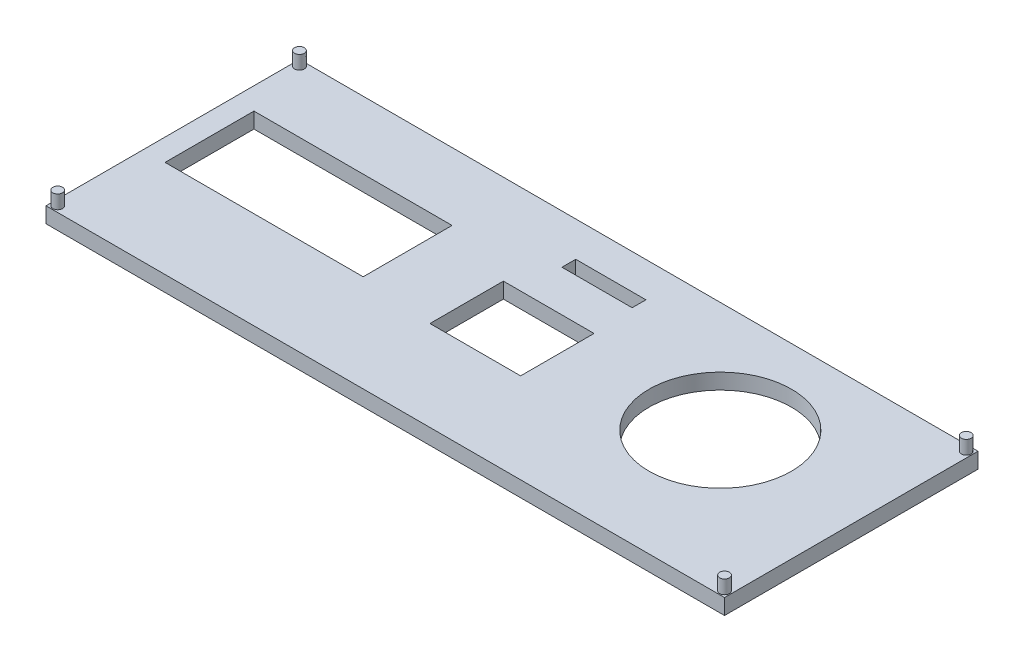
ISO-10303-21;
HEADER;
FILE_DESCRIPTION(('STEP AP214'),'2;1');
FILE_NAME('part.step','',(''),(''),'','','');
FILE_SCHEMA(('AUTOMOTIVE_DESIGN { 1 0 10303 214 1 1 1 1 }'));
ENDSEC;
DATA;
#1=APPLICATION_CONTEXT('core data for automotive mechanical design processes');
#2=APPLICATION_PROTOCOL_DEFINITION('international standard','automotive_design',2000,#1);
#3=PRODUCT_CONTEXT('',#1,'mechanical');
#4=PRODUCT('Part','Part','',(#3));
#5=PRODUCT_RELATED_PRODUCT_CATEGORY('part','',(#4));
#6=PRODUCT_DEFINITION_FORMATION('','',#4);
#7=PRODUCT_DEFINITION_CONTEXT('part definition',#1,'design');
#8=PRODUCT_DEFINITION('design','',#6,#7);
#9=PRODUCT_DEFINITION_SHAPE('','',#8);
#10=(LENGTH_UNIT() NAMED_UNIT(*) SI_UNIT(.MILLI.,.METRE.));
#11=(NAMED_UNIT(*) PLANE_ANGLE_UNIT() SI_UNIT($,.RADIAN.));
#12=(NAMED_UNIT(*) SI_UNIT($,.STERADIAN.) SOLID_ANGLE_UNIT());
#13=UNCERTAINTY_MEASURE_WITH_UNIT(LENGTH_MEASURE(1.E-05),#10,'distance_accuracy_value','');
#14=(GEOMETRIC_REPRESENTATION_CONTEXT(3) GLOBAL_UNCERTAINTY_ASSIGNED_CONTEXT((#13)) GLOBAL_UNIT_ASSIGNED_CONTEXT((#10,
#11,#12)) REPRESENTATION_CONTEXT('',''));
#15=CARTESIAN_POINT('',(0.,0.,0.));
#16=DIRECTION('',(0.,0.,1.));
#17=DIRECTION('',(1.,0.,0.));
#18=AXIS2_PLACEMENT_3D('',#15,#16,#17);
#19=CARTESIAN_POINT('',(-87.,4.,32.5));
#20=DIRECTION('',(1.,0.,0.));
#21=DIRECTION('',(0.,0.,-1.));
#22=AXIS2_PLACEMENT_3D('',#19,#20,#21);
#23=PLANE('',#22);
#24=DIRECTION('',(0.,0.,1.));
#25=VECTOR('',#24,1.);
#26=CARTESIAN_POINT('',(-87.,0.,32.5));
#27=LINE('',#26,#25);
#28=CARTESIAN_POINT('',(-87.,0.,-32.5));
#29=VERTEX_POINT('',#28);
#30=CARTESIAN_POINT('',(-87.,0.,32.5));
#31=VERTEX_POINT('',#30);
#32=EDGE_CURVE('E259',#29,#31,#27,.T.);
#33=ORIENTED_EDGE('',*,*,#32,.T.);
#34=DIRECTION('',(0.,-1.,0.));
#35=VECTOR('',#34,1.);
#36=CARTESIAN_POINT('',(-87.,4.,32.5));
#37=LINE('',#36,#35);
#38=CARTESIAN_POINT('',(-87.,4.,32.5));
#39=VERTEX_POINT('',#38);
#40=EDGE_CURVE('E11',#39,#31,#37,.T.);
#41=ORIENTED_EDGE('',*,*,#40,.F.);
#42=DIRECTION('',(0.,0.,1.));
#43=VECTOR('',#42,1.);
#44=CARTESIAN_POINT('',(-87.,4.,32.5));
#45=LINE('',#44,#43);
#46=CARTESIAN_POINT('',(-87.,4.,-32.5));
#47=VERTEX_POINT('',#46);
#48=EDGE_CURVE('E262',#47,#39,#45,.T.);
#49=ORIENTED_EDGE('',*,*,#48,.F.);
#50=DIRECTION('',(0.,-1.,0.));
#51=VECTOR('',#50,1.);
#52=CARTESIAN_POINT('',(-87.,4.,-32.5));
#53=LINE('',#52,#51);
#54=EDGE_CURVE('E272',#47,#29,#53,.T.);
#55=ORIENTED_EDGE('',*,*,#54,.T.);
#56=EDGE_LOOP('',(#33,#41,#49,#55));
#57=FACE_BOUND('',#56,.T.);
#58=ADVANCED_FACE('F39',(#57),#23,.F.);
#59=CARTESIAN_POINT('',(87.,4.,32.5));
#60=DIRECTION('',(0.,0.,-1.));
#61=DIRECTION('',(-1.,0.,0.));
#62=AXIS2_PLACEMENT_3D('',#59,#60,#61);
#63=PLANE('',#62);
#64=DIRECTION('',(1.,0.,0.));
#65=VECTOR('',#64,1.);
#66=CARTESIAN_POINT('',(87.,0.,32.5));
#67=LINE('',#66,#65);
#68=CARTESIAN_POINT('',(87.,0.,32.5));
#69=VERTEX_POINT('',#68);
#70=EDGE_CURVE('E275',#31,#69,#67,.T.);
#71=ORIENTED_EDGE('',*,*,#70,.T.);
#72=DIRECTION('',(0.,-1.,0.));
#73=VECTOR('',#72,1.);
#74=CARTESIAN_POINT('',(87.,4.,32.5));
#75=LINE('',#74,#73);
#76=CARTESIAN_POINT('',(87.,4.,32.5));
#77=VERTEX_POINT('',#76);
#78=EDGE_CURVE('E46',#77,#69,#75,.T.);
#79=ORIENTED_EDGE('',*,*,#78,.F.);
#80=DIRECTION('',(1.,0.,0.));
#81=VECTOR('',#80,1.);
#82=CARTESIAN_POINT('',(87.,4.,32.5));
#83=LINE('',#82,#81);
#84=EDGE_CURVE('E265',#39,#77,#83,.T.);
#85=ORIENTED_EDGE('',*,*,#84,.F.);
#86=ORIENTED_EDGE('',*,*,#40,.T.);
#87=EDGE_LOOP('',(#71,#79,#85,#86));
#88=FACE_BOUND('',#87,.T.);
#89=ADVANCED_FACE('F304',(#88),#63,.F.);
#90=CARTESIAN_POINT('',(87.,4.,32.5));
#91=DIRECTION('',(-1.,0.,0.));
#92=DIRECTION('',(0.,0.,1.));
#93=AXIS2_PLACEMENT_3D('',#90,#91,#92);
#94=PLANE('',#93);
#95=DIRECTION('',(0.,0.,-1.));
#96=VECTOR('',#95,1.);
#97=CARTESIAN_POINT('',(87.,0.,32.5));
#98=LINE('',#97,#96);
#99=CARTESIAN_POINT('',(87.,0.,-32.5));
#100=VERTEX_POINT('',#99);
#101=EDGE_CURVE('E277',#69,#100,#98,.T.);
#102=ORIENTED_EDGE('',*,*,#101,.T.);
#103=DIRECTION('',(0.,-1.,0.));
#104=VECTOR('',#103,1.);
#105=CARTESIAN_POINT('',(87.,4.,-32.5));
#106=LINE('',#105,#104);
#107=CARTESIAN_POINT('',(87.,4.,-32.5));
#108=VERTEX_POINT('',#107);
#109=EDGE_CURVE('E282',#108,#100,#106,.T.);
#110=ORIENTED_EDGE('',*,*,#109,.F.);
#111=DIRECTION('',(0.,0.,-1.));
#112=VECTOR('',#111,1.);
#113=CARTESIAN_POINT('',(87.,4.,32.5));
#114=LINE('',#113,#112);
#115=EDGE_CURVE('E268',#77,#108,#114,.T.);
#116=ORIENTED_EDGE('',*,*,#115,.F.);
#117=ORIENTED_EDGE('',*,*,#78,.T.);
#118=EDGE_LOOP('',(#102,#110,#116,#117));
#119=FACE_BOUND('',#118,.T.);
#120=ADVANCED_FACE('F289',(#119),#94,.F.);
#121=CARTESIAN_POINT('',(87.,4.,-32.5));
#122=DIRECTION('',(0.,0.,1.));
#123=DIRECTION('',(1.,0.,0.));
#124=AXIS2_PLACEMENT_3D('',#121,#122,#123);
#125=PLANE('',#124);
#126=DIRECTION('',(-1.,0.,0.));
#127=VECTOR('',#126,1.);
#128=CARTESIAN_POINT('',(87.,0.,-32.5));
#129=LINE('',#128,#127);
#130=EDGE_CURVE('E266',#100,#29,#129,.T.);
#131=ORIENTED_EDGE('',*,*,#130,.T.);
#132=ORIENTED_EDGE('',*,*,#54,.F.);
#133=DIRECTION('',(-1.,0.,0.));
#134=VECTOR('',#133,1.);
#135=CARTESIAN_POINT('',(87.,4.,-32.5));
#136=LINE('',#135,#134);
#137=EDGE_CURVE('E270',#108,#47,#136,.T.);
#138=ORIENTED_EDGE('',*,*,#137,.F.);
#139=ORIENTED_EDGE('',*,*,#109,.T.);
#140=EDGE_LOOP('',(#131,#132,#138,#139));
#141=FACE_BOUND('',#140,.T.);
#142=ADVANCED_FACE('F297',(#141),#125,.F.);
#143=CARTESIAN_POINT('',(0.,4.,0.));
#144=DIRECTION('',(0.,1.,0.));
#145=DIRECTION('',(0.,0.,1.));
#146=AXIS2_PLACEMENT_3D('',#143,#144,#145);
#147=PLANE('',#146);
#148=CARTESIAN_POINT('',(85.5,4.,31.));
#149=DIRECTION('',(0.,1.,0.));
#150=DIRECTION('',(0.,0.,1.));
#151=AXIS2_PLACEMENT_3D('',#148,#149,#150);
#152=CIRCLE('',#151,1.25);
#153=CARTESIAN_POINT('',(85.5,4.,32.25));
#154=VERTEX_POINT('',#153);
#155=EDGE_CURVE('E405',#154,#154,#152,.T.);
#156=ORIENTED_EDGE('',*,*,#155,.F.);
#157=EDGE_LOOP('',(#156));
#158=FACE_BOUND('',#157,.T.);
#159=CARTESIAN_POINT('',(85.5,4.,-31.));
#160=DIRECTION('',(0.,1.,0.));
#161=DIRECTION('',(0.,0.,1.));
#162=AXIS2_PLACEMENT_3D('',#159,#160,#161);
#163=CIRCLE('',#162,1.25);
#164=CARTESIAN_POINT('',(85.5,4.,-29.75));
#165=VERTEX_POINT('',#164);
#166=EDGE_CURVE('E406',#165,#165,#163,.T.);
#167=ORIENTED_EDGE('',*,*,#166,.F.);
#168=EDGE_LOOP('',(#167));
#169=FACE_BOUND('',#168,.T.);
#170=CARTESIAN_POINT('',(-85.5,4.,31.));
#171=DIRECTION('',(0.,1.,0.));
#172=DIRECTION('',(0.,0.,1.));
#173=AXIS2_PLACEMENT_3D('',#170,#171,#172);
#174=CIRCLE('',#173,1.25);
#175=CARTESIAN_POINT('',(-85.5,4.,32.25));
#176=VERTEX_POINT('',#175);
#177=EDGE_CURVE('E416',#176,#176,#174,.T.);
#178=ORIENTED_EDGE('',*,*,#177,.F.);
#179=EDGE_LOOP('',(#178));
#180=FACE_BOUND('',#179,.T.);
#181=CARTESIAN_POINT('',(-85.5,4.,-31.));
#182=DIRECTION('',(0.,1.,0.));
#183=DIRECTION('',(0.,0.,1.));
#184=AXIS2_PLACEMENT_3D('',#181,#182,#183);
#185=CIRCLE('',#184,1.25);
#186=CARTESIAN_POINT('',(-85.5,4.,-29.75));
#187=VERTEX_POINT('',#186);
#188=EDGE_CURVE('E175',#187,#187,#185,.T.);
#189=ORIENTED_EDGE('',*,*,#188,.F.);
#190=EDGE_LOOP('',(#189));
#191=FACE_BOUND('',#190,.T.);
#192=DIRECTION('',(0.,0.,-1.));
#193=VECTOR('',#192,1.);
#194=CARTESIAN_POINT('',(11.6243241915725,4.,9.41717402861569));
#195=LINE('',#194,#193);
#196=CARTESIAN_POINT('',(11.6243241915725,4.,9.41717402861569));
#197=VERTEX_POINT('',#196);
#198=CARTESIAN_POINT('',(11.6243241915725,4.,-9.41717402861569));
#199=VERTEX_POINT('',#198);
#200=EDGE_CURVE('E53',#197,#199,#195,.T.);
#201=ORIENTED_EDGE('',*,*,#200,.F.);
#202=DIRECTION('',(1.,0.,0.));
#203=VECTOR('',#202,1.);
#204=CARTESIAN_POINT('',(-11.6243241915725,4.,9.41717402861569));
#205=LINE('',#204,#203);
#206=CARTESIAN_POINT('',(-11.6243241915725,4.,9.41717402861569));
#207=VERTEX_POINT('',#206);
#208=EDGE_CURVE('E169',#207,#197,#205,.T.);
#209=ORIENTED_EDGE('',*,*,#208,.F.);
#210=DIRECTION('',(0.,0.,1.));
#211=VECTOR('',#210,1.);
#212=CARTESIAN_POINT('',(-11.6243241915725,4.,9.41717402861569));
#213=LINE('',#212,#211);
#214=CARTESIAN_POINT('',(-11.6243241915725,4.,-9.41717402861569));
#215=VERTEX_POINT('',#214);
#216=EDGE_CURVE('E172',#215,#207,#213,.T.);
#217=ORIENTED_EDGE('',*,*,#216,.F.);
#218=DIRECTION('',(-1.,0.,0.));
#219=VECTOR('',#218,1.);
#220=CARTESIAN_POINT('',(-11.6243241915725,4.,-9.41717402861569));
#221=LINE('',#220,#219);
#222=EDGE_CURVE('E181',#199,#215,#221,.T.);
#223=ORIENTED_EDGE('',*,*,#222,.F.);
#224=EDGE_LOOP('',(#201,#209,#217,#223));
#225=FACE_BOUND('',#224,.T.);
#226=DIRECTION('',(0.,0.,1.));
#227=VECTOR('',#226,1.);
#228=CARTESIAN_POINT('',(-7.19999999999999,4.,-20.0114948108083));
#229=LINE('',#228,#227);
#230=CARTESIAN_POINT('',(-7.19999999999999,4.,-23.5429350715392));
#231=VERTEX_POINT('',#230);
#232=CARTESIAN_POINT('',(-7.19999999999999,4.,-20.0114948108083));
#233=VERTEX_POINT('',#232);
#234=EDGE_CURVE('E188',#231,#233,#229,.T.);
#235=ORIENTED_EDGE('',*,*,#234,.F.);
#236=DIRECTION('',(-1.,0.,0.));
#237=VECTOR('',#236,1.);
#238=CARTESIAN_POINT('',(-7.19999999999999,4.,-23.5429350715392));
#239=LINE('',#238,#237);
#240=CARTESIAN_POINT('',(10.8,4.,-23.5429350715392));
#241=VERTEX_POINT('',#240);
#242=EDGE_CURVE('E196',#241,#231,#239,.T.);
#243=ORIENTED_EDGE('',*,*,#242,.F.);
#244=DIRECTION('',(0.,0.,-1.));
#245=VECTOR('',#244,1.);
#246=CARTESIAN_POINT('',(10.8,4.,-20.0114948108083));
#247=LINE('',#246,#245);
#248=CARTESIAN_POINT('',(10.8,4.,-20.0114948108083));
#249=VERTEX_POINT('',#248);
#250=EDGE_CURVE('E210',#249,#241,#247,.T.);
#251=ORIENTED_EDGE('',*,*,#250,.F.);
#252=DIRECTION('',(1.,0.,0.));
#253=VECTOR('',#252,1.);
#254=CARTESIAN_POINT('',(-7.19999999999999,4.,-20.0114948108083));
#255=LINE('',#254,#253);
#256=EDGE_CURVE('E207',#233,#249,#255,.T.);
#257=ORIENTED_EDGE('',*,*,#256,.F.);
#258=EDGE_LOOP('',(#235,#243,#251,#257));
#259=FACE_BOUND('',#258,.T.);
#260=DIRECTION('',(0.,0.,-1.));
#261=VECTOR('',#260,1.);
#262=CARTESIAN_POINT('',(-30.5702693410073,4.,-15.2));
#263=LINE('',#262,#261);
#264=CARTESIAN_POINT('',(-30.5702693410073,4.,7.59999999999999));
#265=VERTEX_POINT('',#264);
#266=CARTESIAN_POINT('',(-30.5702693410073,4.,-15.2));
#267=VERTEX_POINT('',#266);
#268=EDGE_CURVE('E217',#265,#267,#263,.T.);
#269=ORIENTED_EDGE('',*,*,#268,.F.);
#270=DIRECTION('',(1.,0.,0.));
#271=VECTOR('',#270,1.);
#272=CARTESIAN_POINT('',(-30.5702693410073,4.,7.59999999999999));
#273=LINE('',#272,#271);
#274=CARTESIAN_POINT('',(-81.3702693410073,4.,7.6));
#275=VERTEX_POINT('',#274);
#276=EDGE_CURVE('E228',#275,#265,#273,.T.);
#277=ORIENTED_EDGE('',*,*,#276,.F.);
#278=DIRECTION('',(0.,0.,1.));
#279=VECTOR('',#278,1.);
#280=CARTESIAN_POINT('',(-81.3702693410073,4.,-15.2));
#281=LINE('',#280,#279);
#282=CARTESIAN_POINT('',(-81.3702693410073,4.,-15.2));
#283=VERTEX_POINT('',#282);
#284=EDGE_CURVE('E242',#283,#275,#281,.T.);
#285=ORIENTED_EDGE('',*,*,#284,.F.);
#286=DIRECTION('',(-1.,0.,0.));
#287=VECTOR('',#286,1.);
#288=CARTESIAN_POINT('',(-30.5702693410073,4.,-15.2));
#289=LINE('',#288,#287);
#290=EDGE_CURVE('E239',#267,#283,#289,.T.);
#291=ORIENTED_EDGE('',*,*,#290,.F.);
#292=EDGE_LOOP('',(#269,#277,#285,#291));
#293=FACE_BOUND('',#292,.T.);
#294=CARTESIAN_POINT('',(49.2930203060352,4.,-4.12001363751938));
#295=DIRECTION('',(0.,1.,0.));
#296=DIRECTION('',(0.,0.,1.));
#297=AXIS2_PLACEMENT_3D('',#294,#295,#296);
#298=CIRCLE('',#297,18.25);
#299=CARTESIAN_POINT('',(49.2930203060352,4.,14.1299863624806));
#300=VERTEX_POINT('',#299);
#301=EDGE_CURVE('E249',#300,#300,#298,.T.);
#302=ORIENTED_EDGE('',*,*,#301,.F.);
#303=EDGE_LOOP('',(#302));
#304=FACE_BOUND('',#303,.T.);
#305=ORIENTED_EDGE('',*,*,#48,.T.);
#306=ORIENTED_EDGE('',*,*,#84,.T.);
#307=ORIENTED_EDGE('',*,*,#115,.T.);
#308=ORIENTED_EDGE('',*,*,#137,.T.);
#309=EDGE_LOOP('',(#305,#306,#307,#308));
#310=FACE_BOUND('',#309,.T.);
#311=ADVANCED_FACE('F303',(#158,#169,#180,#191,#225,#259,#293,#304,#310),#147,.T.);
#312=CARTESIAN_POINT('',(0.,0.,0.));
#313=DIRECTION('',(0.,1.,0.));
#314=DIRECTION('',(0.,0.,1.));
#315=AXIS2_PLACEMENT_3D('',#312,#313,#314);
#316=PLANE('',#315);
#317=DIRECTION('',(1.,0.,0.));
#318=VECTOR('',#317,1.);
#319=CARTESIAN_POINT('',(-11.6243241915725,0.,9.41717402861569));
#320=LINE('',#319,#318);
#321=CARTESIAN_POINT('',(-11.6243241915725,0.,9.41717402861569));
#322=VERTEX_POINT('',#321);
#323=CARTESIAN_POINT('',(11.6243241915725,0.,9.41717402861569));
#324=VERTEX_POINT('',#323);
#325=EDGE_CURVE('E159',#322,#324,#320,.T.);
#326=ORIENTED_EDGE('',*,*,#325,.T.);
#327=DIRECTION('',(0.,0.,-1.));
#328=VECTOR('',#327,1.);
#329=CARTESIAN_POINT('',(11.6243241915725,0.,9.41717402861569));
#330=LINE('',#329,#328);
#331=CARTESIAN_POINT('',(11.6243241915725,0.,-9.41717402861569));
#332=VERTEX_POINT('',#331);
#333=EDGE_CURVE('E153',#324,#332,#330,.T.);
#334=ORIENTED_EDGE('',*,*,#333,.T.);
#335=DIRECTION('',(-1.,0.,0.));
#336=VECTOR('',#335,1.);
#337=CARTESIAN_POINT('',(-11.6243241915725,0.,-9.41717402861569));
#338=LINE('',#337,#336);
#339=CARTESIAN_POINT('',(-11.6243241915725,0.,-9.41717402861569));
#340=VERTEX_POINT('',#339);
#341=EDGE_CURVE('E162',#332,#340,#338,.T.);
#342=ORIENTED_EDGE('',*,*,#341,.T.);
#343=DIRECTION('',(0.,0.,1.));
#344=VECTOR('',#343,1.);
#345=CARTESIAN_POINT('',(-11.6243241915725,0.,9.41717402861569));
#346=LINE('',#345,#344);
#347=EDGE_CURVE('E61',#340,#322,#346,.T.);
#348=ORIENTED_EDGE('',*,*,#347,.T.);
#349=EDGE_LOOP('',(#326,#334,#342,#348));
#350=FACE_BOUND('',#349,.T.);
#351=DIRECTION('',(-1.,0.,0.));
#352=VECTOR('',#351,1.);
#353=CARTESIAN_POINT('',(-7.19999999999999,0.,-23.5429350715392));
#354=LINE('',#353,#352);
#355=CARTESIAN_POINT('',(10.8,0.,-23.5429350715392));
#356=VERTEX_POINT('',#355);
#357=CARTESIAN_POINT('',(-7.19999999999999,0.,-23.5429350715392));
#358=VERTEX_POINT('',#357);
#359=EDGE_CURVE('E202',#356,#358,#354,.T.);
#360=ORIENTED_EDGE('',*,*,#359,.T.);
#361=DIRECTION('',(0.,0.,1.));
#362=VECTOR('',#361,1.);
#363=CARTESIAN_POINT('',(-7.19999999999999,0.,-20.0114948108083));
#364=LINE('',#363,#362);
#365=CARTESIAN_POINT('',(-7.19999999999999,0.,-20.0114948108083));
#366=VERTEX_POINT('',#365);
#367=EDGE_CURVE('E192',#358,#366,#364,.T.);
#368=ORIENTED_EDGE('',*,*,#367,.T.);
#369=DIRECTION('',(1.,0.,0.));
#370=VECTOR('',#369,1.);
#371=CARTESIAN_POINT('',(-7.19999999999999,0.,-20.0114948108083));
#372=LINE('',#371,#370);
#373=CARTESIAN_POINT('',(10.8,0.,-20.0114948108083));
#374=VERTEX_POINT('',#373);
#375=EDGE_CURVE('E195',#366,#374,#372,.T.);
#376=ORIENTED_EDGE('',*,*,#375,.T.);
#377=DIRECTION('',(0.,0.,-1.));
#378=VECTOR('',#377,1.);
#379=CARTESIAN_POINT('',(10.8,0.,-20.0114948108083));
#380=LINE('',#379,#378);
#381=EDGE_CURVE('E199',#374,#356,#380,.T.);
#382=ORIENTED_EDGE('',*,*,#381,.T.);
#383=EDGE_LOOP('',(#360,#368,#376,#382));
#384=FACE_BOUND('',#383,.T.);
#385=DIRECTION('',(1.,0.,0.));
#386=VECTOR('',#385,1.);
#387=CARTESIAN_POINT('',(-30.5702693410073,0.,7.59999999999999));
#388=LINE('',#387,#386);
#389=CARTESIAN_POINT('',(-81.3702693410073,0.,7.6));
#390=VERTEX_POINT('',#389);
#391=CARTESIAN_POINT('',(-30.5702693410073,0.,7.59999999999999));
#392=VERTEX_POINT('',#391);
#393=EDGE_CURVE('E234',#390,#392,#388,.T.);
#394=ORIENTED_EDGE('',*,*,#393,.T.);
#395=DIRECTION('',(0.,0.,-1.));
#396=VECTOR('',#395,1.);
#397=CARTESIAN_POINT('',(-30.5702693410073,0.,-15.2));
#398=LINE('',#397,#396);
#399=CARTESIAN_POINT('',(-30.5702693410073,0.,-15.2));
#400=VERTEX_POINT('',#399);
#401=EDGE_CURVE('E224',#392,#400,#398,.T.);
#402=ORIENTED_EDGE('',*,*,#401,.T.);
#403=DIRECTION('',(-1.,0.,0.));
#404=VECTOR('',#403,1.);
#405=CARTESIAN_POINT('',(-30.5702693410073,0.,-15.2));
#406=LINE('',#405,#404);
#407=CARTESIAN_POINT('',(-81.3702693410073,0.,-15.2));
#408=VERTEX_POINT('',#407);
#409=EDGE_CURVE('E227',#400,#408,#406,.T.);
#410=ORIENTED_EDGE('',*,*,#409,.T.);
#411=DIRECTION('',(0.,0.,1.));
#412=VECTOR('',#411,1.);
#413=CARTESIAN_POINT('',(-81.3702693410073,0.,-15.2));
#414=LINE('',#413,#412);
#415=EDGE_CURVE('E231',#408,#390,#414,.T.);
#416=ORIENTED_EDGE('',*,*,#415,.T.);
#417=EDGE_LOOP('',(#394,#402,#410,#416));
#418=FACE_BOUND('',#417,.T.);
#419=CARTESIAN_POINT('',(49.2930203060352,0.,-4.12001363751938));
#420=DIRECTION('',(0.,1.,0.));
#421=DIRECTION('',(0.,0.,1.));
#422=AXIS2_PLACEMENT_3D('',#419,#420,#421);
#423=CIRCLE('',#422,18.25);
#424=CARTESIAN_POINT('',(49.2930203060352,0.,14.1299863624806));
#425=VERTEX_POINT('',#424);
#426=EDGE_CURVE('E256',#425,#425,#423,.T.);
#427=ORIENTED_EDGE('',*,*,#426,.T.);
#428=EDGE_LOOP('',(#427));
#429=FACE_BOUND('',#428,.T.);
#430=ORIENTED_EDGE('',*,*,#32,.F.);
#431=ORIENTED_EDGE('',*,*,#130,.F.);
#432=ORIENTED_EDGE('',*,*,#101,.F.);
#433=ORIENTED_EDGE('',*,*,#70,.F.);
#434=EDGE_LOOP('',(#430,#431,#432,#433));
#435=FACE_BOUND('',#434,.T.);
#436=ADVANCED_FACE('F166',(#350,#384,#418,#429,#435),#316,.F.);
#437=CARTESIAN_POINT('',(49.2930203060352,0.,-4.12001363751938));
#438=DIRECTION('',(0.,1.,0.));
#439=DIRECTION('',(0.,0.,1.));
#440=AXIS2_PLACEMENT_3D('',#437,#438,#439);
#441=CYLINDRICAL_SURFACE('',#440,18.25);
#442=ORIENTED_EDGE('',*,*,#426,.F.);
#443=EDGE_LOOP('',(#442));
#444=FACE_BOUND('',#443,.T.);
#445=ORIENTED_EDGE('',*,*,#301,.T.);
#446=EDGE_LOOP('',(#445));
#447=FACE_BOUND('',#446,.T.);
#448=ADVANCED_FACE('F316',(#444,#447),#441,.F.);
#449=CARTESIAN_POINT('',(-30.5702693410073,0.,-15.2));
#450=DIRECTION('',(1.,0.,0.));
#451=DIRECTION('',(0.,0.,-1.));
#452=AXIS2_PLACEMENT_3D('',#449,#450,#451);
#453=PLANE('',#452);
#454=ORIENTED_EDGE('',*,*,#268,.T.);
#455=DIRECTION('',(0.,1.,0.));
#456=VECTOR('',#455,1.);
#457=CARTESIAN_POINT('',(-30.5702693410073,0.,-15.2));
#458=LINE('',#457,#456);
#459=EDGE_CURVE('E237',#400,#267,#458,.T.);
#460=ORIENTED_EDGE('',*,*,#459,.F.);
#461=ORIENTED_EDGE('',*,*,#401,.F.);
#462=DIRECTION('',(0.,1.,0.));
#463=VECTOR('',#462,1.);
#464=CARTESIAN_POINT('',(-30.5702693410073,0.,7.59999999999999));
#465=LINE('',#464,#463);
#466=EDGE_CURVE('E247',#392,#265,#465,.T.);
#467=ORIENTED_EDGE('',*,*,#466,.T.);
#468=EDGE_LOOP('',(#454,#460,#461,#467));
#469=FACE_BOUND('',#468,.T.);
#470=ADVANCED_FACE('F322',(#469),#453,.F.);
#471=CARTESIAN_POINT('',(-30.5702693410073,0.,7.59999999999999));
#472=DIRECTION('',(0.,0.,1.));
#473=DIRECTION('',(1.,0.,0.));
#474=AXIS2_PLACEMENT_3D('',#471,#472,#473);
#475=PLANE('',#474);
#476=ORIENTED_EDGE('',*,*,#276,.T.);
#477=ORIENTED_EDGE('',*,*,#466,.F.);
#478=ORIENTED_EDGE('',*,*,#393,.F.);
#479=DIRECTION('',(0.,1.,0.));
#480=VECTOR('',#479,1.);
#481=CARTESIAN_POINT('',(-81.3702693410073,0.,7.6));
#482=LINE('',#481,#480);
#483=EDGE_CURVE('E250',#390,#275,#482,.T.);
#484=ORIENTED_EDGE('',*,*,#483,.T.);
#485=EDGE_LOOP('',(#476,#477,#478,#484));
#486=FACE_BOUND('',#485,.T.);
#487=ADVANCED_FACE('F326',(#486),#475,.F.);
#488=CARTESIAN_POINT('',(-81.3702693410073,0.,-15.2));
#489=DIRECTION('',(-1.,0.,0.));
#490=DIRECTION('',(0.,0.,1.));
#491=AXIS2_PLACEMENT_3D('',#488,#489,#490);
#492=PLANE('',#491);
#493=ORIENTED_EDGE('',*,*,#284,.T.);
#494=ORIENTED_EDGE('',*,*,#483,.F.);
#495=ORIENTED_EDGE('',*,*,#415,.F.);
#496=DIRECTION('',(0.,1.,0.));
#497=VECTOR('',#496,1.);
#498=CARTESIAN_POINT('',(-81.3702693410073,0.,-15.2));
#499=LINE('',#498,#497);
#500=EDGE_CURVE('E252',#408,#283,#499,.T.);
#501=ORIENTED_EDGE('',*,*,#500,.T.);
#502=EDGE_LOOP('',(#493,#494,#495,#501));
#503=FACE_BOUND('',#502,.T.);
#504=ADVANCED_FACE('F332',(#503),#492,.F.);
#505=CARTESIAN_POINT('',(-30.5702693410073,0.,-15.2));
#506=DIRECTION('',(0.,0.,-1.));
#507=DIRECTION('',(-1.,0.,0.));
#508=AXIS2_PLACEMENT_3D('',#505,#506,#507);
#509=PLANE('',#508);
#510=ORIENTED_EDGE('',*,*,#290,.T.);
#511=ORIENTED_EDGE('',*,*,#500,.F.);
#512=ORIENTED_EDGE('',*,*,#409,.F.);
#513=ORIENTED_EDGE('',*,*,#459,.T.);
#514=EDGE_LOOP('',(#510,#511,#512,#513));
#515=FACE_BOUND('',#514,.T.);
#516=ADVANCED_FACE('F328',(#515),#509,.F.);
#517=CARTESIAN_POINT('',(-7.19999999999999,0.,-20.0114948108083));
#518=DIRECTION('',(-1.,0.,0.));
#519=DIRECTION('',(0.,0.,1.));
#520=AXIS2_PLACEMENT_3D('',#517,#518,#519);
#521=PLANE('',#520);
#522=ORIENTED_EDGE('',*,*,#234,.T.);
#523=DIRECTION('',(0.,1.,0.));
#524=VECTOR('',#523,1.);
#525=CARTESIAN_POINT('',(-7.19999999999999,0.,-20.0114948108083));
#526=LINE('',#525,#524);
#527=EDGE_CURVE('E205',#366,#233,#526,.T.);
#528=ORIENTED_EDGE('',*,*,#527,.F.);
#529=ORIENTED_EDGE('',*,*,#367,.F.);
#530=DIRECTION('',(0.,1.,0.));
#531=VECTOR('',#530,1.);
#532=CARTESIAN_POINT('',(-7.19999999999999,0.,-23.5429350715392));
#533=LINE('',#532,#531);
#534=EDGE_CURVE('E215',#358,#231,#533,.T.);
#535=ORIENTED_EDGE('',*,*,#534,.T.);
#536=EDGE_LOOP('',(#522,#528,#529,#535));
#537=FACE_BOUND('',#536,.T.);
#538=ADVANCED_FACE('F331',(#537),#521,.F.);
#539=CARTESIAN_POINT('',(-7.19999999999999,0.,-23.5429350715392));
#540=DIRECTION('',(0.,0.,-1.));
#541=DIRECTION('',(-1.,0.,0.));
#542=AXIS2_PLACEMENT_3D('',#539,#540,#541);
#543=PLANE('',#542);
#544=ORIENTED_EDGE('',*,*,#242,.T.);
#545=ORIENTED_EDGE('',*,*,#534,.F.);
#546=ORIENTED_EDGE('',*,*,#359,.F.);
#547=DIRECTION('',(0.,1.,0.));
#548=VECTOR('',#547,1.);
#549=CARTESIAN_POINT('',(10.8,0.,-23.5429350715392));
#550=LINE('',#549,#548);
#551=EDGE_CURVE('E218',#356,#241,#550,.T.);
#552=ORIENTED_EDGE('',*,*,#551,.T.);
#553=EDGE_LOOP('',(#544,#545,#546,#552));
#554=FACE_BOUND('',#553,.T.);
#555=ADVANCED_FACE('F342',(#554),#543,.F.);
#556=CARTESIAN_POINT('',(10.8,0.,-20.0114948108083));
#557=DIRECTION('',(1.,0.,0.));
#558=DIRECTION('',(0.,0.,-1.));
#559=AXIS2_PLACEMENT_3D('',#556,#557,#558);
#560=PLANE('',#559);
#561=ORIENTED_EDGE('',*,*,#250,.T.);
#562=ORIENTED_EDGE('',*,*,#551,.F.);
#563=ORIENTED_EDGE('',*,*,#381,.F.);
#564=DIRECTION('',(0.,1.,0.));
#565=VECTOR('',#564,1.);
#566=CARTESIAN_POINT('',(10.8,0.,-20.0114948108083));
#567=LINE('',#566,#565);
#568=EDGE_CURVE('E220',#374,#249,#567,.T.);
#569=ORIENTED_EDGE('',*,*,#568,.T.);
#570=EDGE_LOOP('',(#561,#562,#563,#569));
#571=FACE_BOUND('',#570,.T.);
#572=ADVANCED_FACE('F347',(#571),#560,.F.);
#573=CARTESIAN_POINT('',(-7.19999999999999,0.,-20.0114948108083));
#574=DIRECTION('',(0.,0.,1.));
#575=DIRECTION('',(1.,0.,0.));
#576=AXIS2_PLACEMENT_3D('',#573,#574,#575);
#577=PLANE('',#576);
#578=ORIENTED_EDGE('',*,*,#256,.T.);
#579=ORIENTED_EDGE('',*,*,#568,.F.);
#580=ORIENTED_EDGE('',*,*,#375,.F.);
#581=ORIENTED_EDGE('',*,*,#527,.T.);
#582=EDGE_LOOP('',(#578,#579,#580,#581));
#583=FACE_BOUND('',#582,.T.);
#584=ADVANCED_FACE('F344',(#583),#577,.F.);
#585=CARTESIAN_POINT('',(11.6243241915725,0.,9.41717402861569));
#586=DIRECTION('',(1.,0.,0.));
#587=DIRECTION('',(0.,0.,-1.));
#588=AXIS2_PLACEMENT_3D('',#585,#586,#587);
#589=PLANE('',#588);
#590=ORIENTED_EDGE('',*,*,#200,.T.);
#591=DIRECTION('',(0.,1.,0.));
#592=VECTOR('',#591,1.);
#593=CARTESIAN_POINT('',(11.6243241915725,0.,-9.41717402861569));
#594=LINE('',#593,#592);
#595=EDGE_CURVE('E149',#332,#199,#594,.T.);
#596=ORIENTED_EDGE('',*,*,#595,.F.);
#597=ORIENTED_EDGE('',*,*,#333,.F.);
#598=DIRECTION('',(0.,1.,0.));
#599=VECTOR('',#598,1.);
#600=CARTESIAN_POINT('',(11.6243241915725,0.,9.41717402861569));
#601=LINE('',#600,#599);
#602=EDGE_CURVE('E186',#324,#197,#601,.T.);
#603=ORIENTED_EDGE('',*,*,#602,.T.);
#604=EDGE_LOOP('',(#590,#596,#597,#603));
#605=FACE_BOUND('',#604,.T.);
#606=ADVANCED_FACE('F151',(#605),#589,.F.);
#607=CARTESIAN_POINT('',(-11.6243241915725,0.,9.41717402861569));
#608=DIRECTION('',(0.,0.,1.));
#609=DIRECTION('',(1.,0.,0.));
#610=AXIS2_PLACEMENT_3D('',#607,#608,#609);
#611=PLANE('',#610);
#612=ORIENTED_EDGE('',*,*,#208,.T.);
#613=ORIENTED_EDGE('',*,*,#602,.F.);
#614=ORIENTED_EDGE('',*,*,#325,.F.);
#615=DIRECTION('',(0.,1.,0.));
#616=VECTOR('',#615,1.);
#617=CARTESIAN_POINT('',(-11.6243241915725,0.,9.41717402861569));
#618=LINE('',#617,#616);
#619=EDGE_CURVE('E189',#322,#207,#618,.T.);
#620=ORIENTED_EDGE('',*,*,#619,.T.);
#621=EDGE_LOOP('',(#612,#613,#614,#620));
#622=FACE_BOUND('',#621,.T.);
#623=ADVANCED_FACE('F357',(#622),#611,.F.);
#624=CARTESIAN_POINT('',(-11.6243241915725,0.,9.41717402861569));
#625=DIRECTION('',(-1.,0.,0.));
#626=DIRECTION('',(0.,0.,1.));
#627=AXIS2_PLACEMENT_3D('',#624,#625,#626);
#628=PLANE('',#627);
#629=ORIENTED_EDGE('',*,*,#216,.T.);
#630=ORIENTED_EDGE('',*,*,#619,.F.);
#631=ORIENTED_EDGE('',*,*,#347,.F.);
#632=DIRECTION('',(0.,1.,0.));
#633=VECTOR('',#632,1.);
#634=CARTESIAN_POINT('',(-11.6243241915725,0.,-9.41717402861569));
#635=LINE('',#634,#633);
#636=EDGE_CURVE('E158',#340,#215,#635,.T.);
#637=ORIENTED_EDGE('',*,*,#636,.T.);
#638=EDGE_LOOP('',(#629,#630,#631,#637));
#639=FACE_BOUND('',#638,.T.);
#640=ADVANCED_FACE('F361',(#639),#628,.F.);
#641=CARTESIAN_POINT('',(-11.6243241915725,0.,-9.41717402861569));
#642=DIRECTION('',(0.,0.,-1.));
#643=DIRECTION('',(-1.,0.,0.));
#644=AXIS2_PLACEMENT_3D('',#641,#642,#643);
#645=PLANE('',#644);
#646=ORIENTED_EDGE('',*,*,#222,.T.);
#647=ORIENTED_EDGE('',*,*,#636,.F.);
#648=ORIENTED_EDGE('',*,*,#341,.F.);
#649=ORIENTED_EDGE('',*,*,#595,.T.);
#650=EDGE_LOOP('',(#646,#647,#648,#649));
#651=FACE_BOUND('',#650,.T.);
#652=ADVANCED_FACE('F163',(#651),#645,.F.);
#653=CARTESIAN_POINT('',(-85.5,7.5,-31.));
#654=DIRECTION('',(0.,-1.,0.));
#655=DIRECTION('',(0.,0.,-1.));
#656=AXIS2_PLACEMENT_3D('',#653,#654,#655);
#657=CYLINDRICAL_SURFACE('',#656,1.25);
#658=CARTESIAN_POINT('',(-85.5,7.5,-31.));
#659=DIRECTION('',(0.,1.,0.));
#660=DIRECTION('',(0.,0.,1.));
#661=AXIS2_PLACEMENT_3D('',#658,#659,#660);
#662=CIRCLE('',#661,1.25);
#663=CARTESIAN_POINT('',(-85.5,7.5,-29.75));
#664=VERTEX_POINT('',#663);
#665=EDGE_CURVE('E182',#664,#664,#662,.T.);
#666=ORIENTED_EDGE('',*,*,#665,.F.);
#667=EDGE_LOOP('',(#666));
#668=FACE_BOUND('',#667,.T.);
#669=ORIENTED_EDGE('',*,*,#188,.T.);
#670=EDGE_LOOP('',(#669));
#671=FACE_BOUND('',#670,.T.);
#672=ADVANCED_FACE('F360',(#668,#671),#657,.T.);
#673=CARTESIAN_POINT('',(-85.5,7.5,-31.));
#674=DIRECTION('',(0.,1.,0.));
#675=DIRECTION('',(0.,0.,1.));
#676=AXIS2_PLACEMENT_3D('',#673,#674,#675);
#677=PLANE('',#676);
#678=ORIENTED_EDGE('',*,*,#665,.T.);
#679=EDGE_LOOP('',(#678));
#680=FACE_BOUND('',#679,.T.);
#681=ADVANCED_FACE('F369',(#680),#677,.T.);
#682=CARTESIAN_POINT('',(-85.5,7.5,31.));
#683=DIRECTION('',(0.,-1.,0.));
#684=DIRECTION('',(0.,0.,-1.));
#685=AXIS2_PLACEMENT_3D('',#682,#683,#684);
#686=CYLINDRICAL_SURFACE('',#685,1.25);
#687=CARTESIAN_POINT('',(-85.5,7.5,31.));
#688=DIRECTION('',(0.,1.,0.));
#689=DIRECTION('',(0.,0.,1.));
#690=AXIS2_PLACEMENT_3D('',#687,#688,#689);
#691=CIRCLE('',#690,1.25);
#692=CARTESIAN_POINT('',(-85.5,7.5,32.25));
#693=VERTEX_POINT('',#692);
#694=EDGE_CURVE('E414',#693,#693,#691,.T.);
#695=ORIENTED_EDGE('',*,*,#694,.F.);
#696=EDGE_LOOP('',(#695));
#697=FACE_BOUND('',#696,.T.);
#698=ORIENTED_EDGE('',*,*,#177,.T.);
#699=EDGE_LOOP('',(#698));
#700=FACE_BOUND('',#699,.T.);
#701=ADVANCED_FACE('F373',(#697,#700),#686,.T.);
#702=CARTESIAN_POINT('',(-85.5,7.5,31.));
#703=DIRECTION('',(0.,1.,0.));
#704=DIRECTION('',(0.,0.,1.));
#705=AXIS2_PLACEMENT_3D('',#702,#703,#704);
#706=PLANE('',#705);
#707=ORIENTED_EDGE('',*,*,#694,.T.);
#708=EDGE_LOOP('',(#707));
#709=FACE_BOUND('',#708,.T.);
#710=ADVANCED_FACE('F375',(#709),#706,.T.);
#711=CARTESIAN_POINT('',(85.5,7.5,-31.));
#712=DIRECTION('',(0.,-1.,0.));
#713=DIRECTION('',(0.,0.,-1.));
#714=AXIS2_PLACEMENT_3D('',#711,#712,#713);
#715=CYLINDRICAL_SURFACE('',#714,1.25);
#716=CARTESIAN_POINT('',(85.5,7.5,-31.));
#717=DIRECTION('',(0.,1.,0.));
#718=DIRECTION('',(0.,0.,1.));
#719=AXIS2_PLACEMENT_3D('',#716,#717,#718);
#720=CIRCLE('',#719,1.25);
#721=CARTESIAN_POINT('',(85.5,7.5,-29.75));
#722=VERTEX_POINT('',#721);
#723=EDGE_CURVE('E409',#722,#722,#720,.T.);
#724=ORIENTED_EDGE('',*,*,#723,.F.);
#725=EDGE_LOOP('',(#724));
#726=FACE_BOUND('',#725,.T.);
#727=ORIENTED_EDGE('',*,*,#166,.T.);
#728=EDGE_LOOP('',(#727));
#729=FACE_BOUND('',#728,.T.);
#730=ADVANCED_FACE('F378',(#726,#729),#715,.T.);
#731=CARTESIAN_POINT('',(85.5,7.5,-31.));
#732=DIRECTION('',(0.,1.,0.));
#733=DIRECTION('',(0.,0.,1.));
#734=AXIS2_PLACEMENT_3D('',#731,#732,#733);
#735=PLANE('',#734);
#736=ORIENTED_EDGE('',*,*,#723,.T.);
#737=EDGE_LOOP('',(#736));
#738=FACE_BOUND('',#737,.T.);
#739=ADVANCED_FACE('F385',(#738),#735,.T.);
#740=CARTESIAN_POINT('',(85.5,7.5,31.));
#741=DIRECTION('',(0.,-1.,0.));
#742=DIRECTION('',(0.,0.,-1.));
#743=AXIS2_PLACEMENT_3D('',#740,#741,#742);
#744=CYLINDRICAL_SURFACE('',#743,1.25);
#745=CARTESIAN_POINT('',(85.5,7.5,31.));
#746=DIRECTION('',(0.,1.,0.));
#747=DIRECTION('',(0.,0.,1.));
#748=AXIS2_PLACEMENT_3D('',#745,#746,#747);
#749=CIRCLE('',#748,1.25);
#750=CARTESIAN_POINT('',(85.5,7.5,32.25));
#751=VERTEX_POINT('',#750);
#752=EDGE_CURVE('E402',#751,#751,#749,.T.);
#753=ORIENTED_EDGE('',*,*,#752,.F.);
#754=EDGE_LOOP('',(#753));
#755=FACE_BOUND('',#754,.T.);
#756=ORIENTED_EDGE('',*,*,#155,.T.);
#757=EDGE_LOOP('',(#756));
#758=FACE_BOUND('',#757,.T.);
#759=ADVANCED_FACE('F389',(#755,#758),#744,.T.);
#760=CARTESIAN_POINT('',(85.5,7.5,31.));
#761=DIRECTION('',(0.,1.,0.));
#762=DIRECTION('',(0.,0.,1.));
#763=AXIS2_PLACEMENT_3D('',#760,#761,#762);
#764=PLANE('',#763);
#765=ORIENTED_EDGE('',*,*,#752,.T.);
#766=EDGE_LOOP('',(#765));
#767=FACE_BOUND('',#766,.T.);
#768=ADVANCED_FACE('F391',(#767),#764,.T.);
#769=CLOSED_SHELL('',(#58,#89,#120,#142,#311,#436,#448,#470,#487,#504,#516,#538,#555,#572,#584,
#606,#623,#640,#652,#672,#681,#701,#710,#730,#739,#759,#768));
#770=MANIFOLD_SOLID_BREP('B2',#769);
#771=ADVANCED_BREP_SHAPE_REPRESENTATION('',(#18,#770),#14);
#772=SHAPE_DEFINITION_REPRESENTATION(#9,#771);
ENDSEC;
END-ISO-10303-21;
